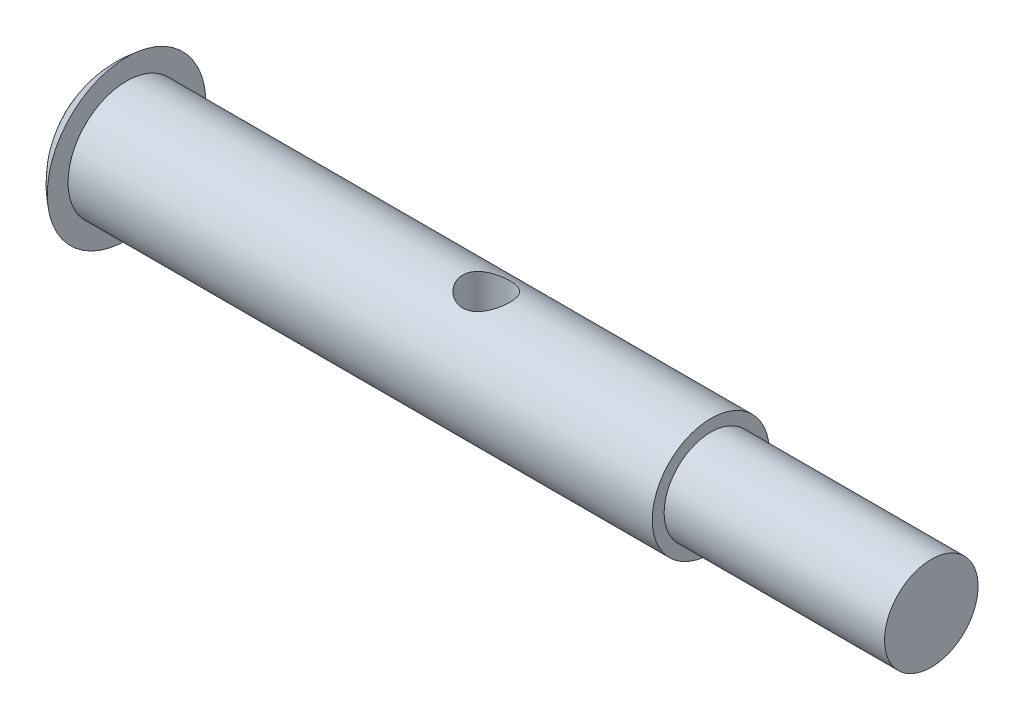
ISO-10303-21;
HEADER;
FILE_DESCRIPTION(('STEP AP214'),'2;1');
FILE_NAME('part.step','',(''),(''),'','','');
FILE_SCHEMA(('AUTOMOTIVE_DESIGN { 1 0 10303 214 1 1 1 1 }'));
ENDSEC;
DATA;
#1=APPLICATION_CONTEXT('core data for automotive mechanical design processes');
#2=APPLICATION_PROTOCOL_DEFINITION('international standard','automotive_design',2000,#1);
#3=PRODUCT_CONTEXT('',#1,'mechanical');
#4=PRODUCT('Part','Part','',(#3));
#5=PRODUCT_RELATED_PRODUCT_CATEGORY('part','',(#4));
#6=PRODUCT_DEFINITION_FORMATION('','',#4);
#7=PRODUCT_DEFINITION_CONTEXT('part definition',#1,'design');
#8=PRODUCT_DEFINITION('design','',#6,#7);
#9=PRODUCT_DEFINITION_SHAPE('','',#8);
#10=(LENGTH_UNIT() NAMED_UNIT(*) SI_UNIT(.MILLI.,.METRE.));
#11=(NAMED_UNIT(*) PLANE_ANGLE_UNIT() SI_UNIT($,.RADIAN.));
#12=(NAMED_UNIT(*) SI_UNIT($,.STERADIAN.) SOLID_ANGLE_UNIT());
#13=UNCERTAINTY_MEASURE_WITH_UNIT(LENGTH_MEASURE(1.E-05),#10,'distance_accuracy_value','');
#14=(GEOMETRIC_REPRESENTATION_CONTEXT(3) GLOBAL_UNCERTAINTY_ASSIGNED_CONTEXT((#13)) GLOBAL_UNIT_ASSIGNED_CONTEXT((#10,
#11,#12)) REPRESENTATION_CONTEXT('',''));
#15=CARTESIAN_POINT('',(0.,0.,0.));
#16=DIRECTION('',(0.,0.,1.));
#17=DIRECTION('',(1.,0.,0.));
#18=AXIS2_PLACEMENT_3D('',#15,#16,#17);
#19=CARTESIAN_POINT('',(2.52749538461538,0.,0.));
#20=DIRECTION('',(-1.,0.,0.));
#21=DIRECTION('',(0.,1.,0.));
#22=AXIS2_PLACEMENT_3D('',#19,#20,#21);
#23=SPHERICAL_SURFACE('',#22,4.17849538461538);
#24=CARTESIAN_POINT('',(0.,0.,0.));
#25=DIRECTION('',(-1.,0.,0.));
#26=DIRECTION('',(0.,0.,1.));
#27=AXIS2_PLACEMENT_3D('',#24,#25,#26);
#28=CIRCLE('',#27,3.3274);
#29=CARTESIAN_POINT('',(0.,0.,3.3274));
#30=VERTEX_POINT('',#29);
#31=EDGE_CURVE('E82',#30,#30,#28,.T.);
#32=ORIENTED_EDGE('',*,*,#31,.T.);
#33=EDGE_LOOP('',(#32));
#34=FACE_BOUND('',#33,.T.);
#35=ADVANCED_FACE('F31',(#34),#23,.T.);
#36=CARTESIAN_POINT('',(33.7566,1.96215,0.));
#37=DIRECTION('',(-1.,0.,0.));
#38=DIRECTION('',(0.,0.,1.));
#39=AXIS2_PLACEMENT_3D('',#36,#37,#38);
#40=PLANE('',#39);
#41=CARTESIAN_POINT('',(33.7566,0.,0.));
#42=DIRECTION('',(-1.,0.,0.));
#43=DIRECTION('',(0.,0.,1.));
#44=AXIS2_PLACEMENT_3D('',#41,#42,#43);
#45=CIRCLE('',#44,1.96215);
#46=CARTESIAN_POINT('',(33.7566,0.,1.96215));
#47=VERTEX_POINT('',#46);
#48=EDGE_CURVE('E10',#47,#47,#45,.T.);
#49=ORIENTED_EDGE('',*,*,#48,.F.);
#50=EDGE_LOOP('',(#49));
#51=FACE_BOUND('',#50,.T.);
#52=ADVANCED_FACE('F74',(#51),#40,.F.);
#53=CARTESIAN_POINT('',(0.,0.,0.));
#54=DIRECTION('',(-1.,0.,0.));
#55=DIRECTION('',(0.,0.,1.));
#56=AXIS2_PLACEMENT_3D('',#53,#54,#55);
#57=CYLINDRICAL_SURFACE('',#56,1.96215);
#58=CARTESIAN_POINT('',(24.511,0.,0.));
#59=DIRECTION('',(-1.,0.,0.));
#60=DIRECTION('',(0.,0.,1.));
#61=AXIS2_PLACEMENT_3D('',#58,#59,#60);
#62=CIRCLE('',#61,1.96215);
#63=CARTESIAN_POINT('',(24.511,0.,1.96215));
#64=VERTEX_POINT('',#63);
#65=EDGE_CURVE('E42',#64,#64,#62,.T.);
#66=ORIENTED_EDGE('',*,*,#65,.F.);
#67=EDGE_LOOP('',(#66));
#68=FACE_BOUND('',#67,.T.);
#69=ORIENTED_EDGE('',*,*,#48,.T.);
#70=EDGE_LOOP('',(#69));
#71=FACE_BOUND('',#70,.T.);
#72=ADVANCED_FACE('F79',(#68,#71),#57,.T.);
#73=CARTESIAN_POINT('',(24.511,2.45745,0.));
#74=DIRECTION('',(-1.,0.,0.));
#75=DIRECTION('',(0.,0.,1.));
#76=AXIS2_PLACEMENT_3D('',#73,#74,#75);
#77=PLANE('',#76);
#78=CARTESIAN_POINT('',(24.511,0.,0.));
#79=DIRECTION('',(-1.,0.,0.));
#80=DIRECTION('',(0.,0.,1.));
#81=AXIS2_PLACEMENT_3D('',#78,#79,#80);
#82=CIRCLE('',#81,2.45745);
#83=CARTESIAN_POINT('',(24.511,0.,2.45745));
#84=VERTEX_POINT('',#83);
#85=EDGE_CURVE('E47',#84,#84,#82,.T.);
#86=ORIENTED_EDGE('',*,*,#85,.F.);
#87=EDGE_LOOP('',(#86));
#88=FACE_BOUND('',#87,.T.);
#89=ORIENTED_EDGE('',*,*,#65,.T.);
#90=EDGE_LOOP('',(#89));
#91=FACE_BOUND('',#90,.T.);
#92=ADVANCED_FACE('F69',(#88,#91),#77,.F.);
#93=CARTESIAN_POINT('',(0.,0.,0.));
#94=DIRECTION('',(-1.,0.,0.));
#95=DIRECTION('',(0.,0.,1.));
#96=AXIS2_PLACEMENT_3D('',#93,#94,#95);
#97=CYLINDRICAL_SURFACE('',#96,2.45745);
#98=CARTESIAN_POINT('',(15.0876,-2.24894911958897,0.990600000000001));
#99=CARTESIAN_POINT('',(15.1406092142013,-2.2489539403931,0.990594883395186));
#100=CARTESIAN_POINT('',(15.1937117818322,-2.25085041266254,0.986318184521201));
#101=CARTESIAN_POINT('',(15.29839478457,-2.25819807241842,0.969371908157784));
#102=CARTESIAN_POINT('',(15.3499705460349,-2.26365918917481,0.956678885541777));
#103=CARTESIAN_POINT('',(15.4499012637466,-2.27740934288236,0.923464359557311));
#104=CARTESIAN_POINT('',(15.4982679250268,-2.28568734080513,0.902973378929544));
#105=CARTESIAN_POINT('',(15.5908617820206,-2.30412268632457,0.854833757596454));
#106=CARTESIAN_POINT('',(15.6350901374237,-2.31427950502426,0.827187130367488));
#107=CARTESIAN_POINT('',(15.7207528721112,-2.33598949570862,0.763800911639134));
#108=CARTESIAN_POINT('',(15.7619170370233,-2.34758805305742,0.727711508573723));
#109=CARTESIAN_POINT('',(15.8378070309952,-2.3705002662306,0.649199752360465));
#110=CARTESIAN_POINT('',(15.872530468698,-2.38181381489308,0.606775057513118));
#111=CARTESIAN_POINT('',(15.9358998686949,-2.40342686867888,0.51470467128262));
#112=CARTESIAN_POINT('',(15.9642459376805,-2.41366744227196,0.464837486163864));
#113=CARTESIAN_POINT('',(16.0120313416552,-2.43142986724061,0.360555800006824));
#114=CARTESIAN_POINT('',(16.0314743909268,-2.43895285209967,0.306143206507078));
#115=CARTESIAN_POINT('',(16.0599352358124,-2.45011121795251,0.19714810345064));
#116=CARTESIAN_POINT('',(16.0694178720317,-2.45391928248367,0.142705007849733));
#117=CARTESIAN_POINT('',(16.0791864790995,-2.45784346670032,0.032876053131032));
#118=CARTESIAN_POINT('',(16.0794759296195,-2.45796098327838,-0.0225094413412587));
#119=CARTESIAN_POINT('',(16.0711027206045,-2.45459528368632,-0.129287199751809));
#120=CARTESIAN_POINT('',(16.0629496483228,-2.4513170310017,-0.180727063337104));
#121=CARTESIAN_POINT('',(16.0387908439381,-2.44180537076067,-0.281436513553462));
#122=CARTESIAN_POINT('',(16.022784535351,-2.43557174625977,-0.330705940569415));
#123=CARTESIAN_POINT('',(15.9831779784075,-2.42063870123337,-0.42656725860649));
#124=CARTESIAN_POINT('',(15.959466596276,-2.41190343171928,-0.473107417596286));
#125=CARTESIAN_POINT('',(15.905227937674,-2.3928317692047,-0.561668723052615));
#126=CARTESIAN_POINT('',(15.8746983102562,-2.38249482432002,-0.603688303390175));
#127=CARTESIAN_POINT('',(15.8053227212193,-2.36045473895841,-0.684985005876058));
#128=CARTESIAN_POINT('',(15.7660585169967,-2.34870645949337,-0.723893510328676));
#129=CARTESIAN_POINT('',(15.6815201438698,-2.32569575134905,-0.794726252527889));
#130=CARTESIAN_POINT('',(15.636243953463,-2.31443348778553,-0.82664813145077));
#131=CARTESIAN_POINT('',(15.5392935246042,-2.29336013633767,-0.883463224418093));
#132=CARTESIAN_POINT('',(15.4874715577675,-2.28360075060554,-0.908125142778779));
#133=CARTESIAN_POINT('',(15.3799119729093,-2.26724605051114,-0.948224879823791));
#134=CARTESIAN_POINT('',(15.3241769724546,-2.26064864367914,-0.963668800271402));
#135=CARTESIAN_POINT('',(15.2140539367204,-2.25187478107706,-0.983989977951191));
#136=CARTESIAN_POINT('',(15.1597955768932,-2.24945027342209,-0.989461353029105));
#137=CARTESIAN_POINT('',(15.051093648822,-2.24858955395276,-0.991417169373309));
#138=CARTESIAN_POINT('',(14.9966501433784,-2.25015210287508,-0.987904403104038));
#139=CARTESIAN_POINT('',(14.8924574407903,-2.25683454392309,-0.972532834316518));
#140=CARTESIAN_POINT('',(14.8426194875695,-2.26174201623547,-0.961171879736541));
#141=CARTESIAN_POINT('',(14.7455916868893,-2.27429639330394,-0.931074816470888));
#142=CARTESIAN_POINT('',(14.6984024351546,-2.28194391149626,-0.91233705618723));
#143=CARTESIAN_POINT('',(14.6058581602916,-2.29949913968596,-0.867163524567918));
#144=CARTESIAN_POINT('',(14.5606571225867,-2.30948650638215,-0.840444220255149));
#145=CARTESIAN_POINT('',(14.4751724206465,-2.33047616641533,-0.780354472980375));
#146=CARTESIAN_POINT('',(14.4348907935572,-2.34147887692108,-0.746981289581171));
#147=CARTESIAN_POINT('',(14.3572375525648,-2.36425892821556,-0.671567777120808));
#148=CARTESIAN_POINT('',(14.3203128717473,-2.37603227040539,-0.629064281035669));
#149=CARTESIAN_POINT('',(14.2540487145552,-2.39825010462983,-0.538184541280385));
#150=CARTESIAN_POINT('',(14.2247095917759,-2.40869453470666,-0.489808023998034));
#151=CARTESIAN_POINT('',(14.1745448270921,-2.42711680118995,-0.388355247919027));
#152=CARTESIAN_POINT('',(14.1537212272328,-2.43509404584713,-0.335277865550409));
#153=CARTESIAN_POINT('',(14.1214387845874,-2.44765523407475,-0.225972068079359));
#154=CARTESIAN_POINT('',(14.1099747647901,-2.45224105339253,-0.169745413333621));
#155=CARTESIAN_POINT('',(14.0973581118665,-2.45729958214545,-0.0597465002267287));
#156=CARTESIAN_POINT('',(14.0955738979861,-2.45802416634502,-0.00605772146768201));
#157=CARTESIAN_POINT('',(14.1006941195384,-2.45596203239521,0.100829284162529));
#158=CARTESIAN_POINT('',(14.1075971984091,-2.45317586246672,0.154027586317364));
#159=CARTESIAN_POINT('',(14.1294441074949,-2.4445325270318,0.256699834667083));
#160=CARTESIAN_POINT('',(14.1441271748982,-2.43877510361329,0.306238339460207));
#161=CARTESIAN_POINT('',(14.1808415573706,-2.42480838128585,0.402138464582342));
#162=CARTESIAN_POINT('',(14.2028743118945,-2.41659860210981,0.448499460442389));
#163=CARTESIAN_POINT('',(14.2547642910696,-2.39807736618839,0.538993056991721));
#164=CARTESIAN_POINT('',(14.2849257021562,-2.38768872922797,0.582935090732998));
#165=CARTESIAN_POINT('',(14.3517616136099,-2.36605819825332,0.665316551286097));
#166=CARTESIAN_POINT('',(14.38843832932,-2.35481601476186,0.703754098400168));
#167=CARTESIAN_POINT('',(14.4699911431742,-2.33186380210035,0.776543117622088));
#168=CARTESIAN_POINT('',(14.5152378400618,-2.32016881507587,0.81048558621844));
#169=CARTESIAN_POINT('',(14.6111672281868,-2.29838717053167,0.870342373324756));
#170=CARTESIAN_POINT('',(14.6618528434755,-2.28830138546427,0.896252344028879));
#171=CARTESIAN_POINT('',(14.7668807220301,-2.27111748811246,0.938942885633635));
#172=CARTESIAN_POINT('',(14.8211865940028,-2.263993687779,0.955802336868846));
#173=CARTESIAN_POINT('',(14.9321339816757,-2.25364625462214,0.979958833150334));
#174=CARTESIAN_POINT('',(14.9887669950462,-2.25040953851769,0.987287962614266));
#175=CARTESIAN_POINT('',(15.0595499687453,-2.24907904719398,0.990303553852822));
#176=CARTESIAN_POINT('',(15.0735717154346,-2.24894784381808,0.990601354051168));
#177=CARTESIAN_POINT('',(15.0876,-2.24894911958897,0.990600000000001));
#178=B_SPLINE_CURVE_WITH_KNOTS('',3,(#98,#99,#100,#101,#102,#103,#104,#105,#106,#107,#108,#109,
#110,#111,#112,#113,#114,#115,#116,#117,#118,#119,#120,#121,#122,#123,#124,#125,#126,#127,#128,
#129,#130,#131,#132,#133,#134,#135,#136,#137,#138,#139,#140,#141,#142,#143,#144,#145,#146,#147,
#148,#149,#150,#151,#152,#153,#154,#155,#156,#157,#158,#159,#160,#161,#162,#163,#164,#165,#166,
#167,#168,#169,#170,#171,#172,#173,#174,#175,#176,#177),.UNSPECIFIED.,.T.,.F.,(4,2,2,2,2,2,2,2,
2,2,2,2,2,2,2,2,2,2,2,2,2,2,2,2,2,2,2,2,2,2,2,2,2,2,2,2,2,2,2,4),(0.,0.158989595529892,
0.318423955298766,0.477240571605475,0.636012548128621,0.803154722040391,0.970358829959495,
1.1442744421613,1.31811743163447,1.48342811584032,1.64867622829381,1.80450042928587,
1.96033607061104,2.11852734800709,2.27677325458184,2.44555054923949,2.61438473886722,
2.78812686876637,2.96175386385342,3.12464906419392,3.28749363935484,3.44085675334786,
3.59425422345659,3.75392637259233,3.91366441994493,4.08542021576384,4.25718401641151,
4.42898898235759,4.60069885429948,4.76105700910075,4.92139012631893,5.07666084164426,
5.23196198500372,5.39416417559913,5.55642162434512,5.72888351514553,5.90143859325839,
6.07246428060505,6.24291269586496,6.28498748083635),.UNSPECIFIED.);
#179=CARTESIAN_POINT('',(15.0876,-2.24894911958897,0.990600000000001));
#180=VERTEX_POINT('',#179);
#181=EDGE_CURVE('E34',#180,#180,#178,.T.);
#182=ORIENTED_EDGE('',*,*,#181,.T.);
#183=EDGE_LOOP('',(#182));
#184=FACE_BOUND('',#183,.T.);
#185=CARTESIAN_POINT('',(15.0876,2.24894911958897,0.990600000000001));
#186=CARTESIAN_POINT('',(15.0345907857987,2.2489539403931,0.990594883395186));
#187=CARTESIAN_POINT('',(14.9814882181678,2.25085041266254,0.986318184521201));
#188=CARTESIAN_POINT('',(14.87680521543,2.25819807241842,0.969371908157785));
#189=CARTESIAN_POINT('',(14.8252294539651,2.26365918917481,0.956678885541777));
#190=CARTESIAN_POINT('',(14.7252987362534,2.27740934288236,0.923464359557311));
#191=CARTESIAN_POINT('',(14.6769320749732,2.28568734080513,0.902973378929544));
#192=CARTESIAN_POINT('',(14.5843382179794,2.30412268632457,0.854833757596454));
#193=CARTESIAN_POINT('',(14.5401098625763,2.31427950502426,0.827187130367488));
#194=CARTESIAN_POINT('',(14.4544471278888,2.33598949570862,0.763800911639134));
#195=CARTESIAN_POINT('',(14.4132829629767,2.34758805305742,0.727711508573725));
#196=CARTESIAN_POINT('',(14.3373929690048,2.3705002662306,0.649199752360467));
#197=CARTESIAN_POINT('',(14.302669531302,2.38181381489308,0.60677505751312));
#198=CARTESIAN_POINT('',(14.2393001313051,2.40342686867888,0.514704671282621));
#199=CARTESIAN_POINT('',(14.2109540623195,2.41366744227196,0.464837486163865));
#200=CARTESIAN_POINT('',(14.1631686583448,2.43142986724061,0.360555800006826));
#201=CARTESIAN_POINT('',(14.1437256090732,2.43895285209967,0.306143206507079));
#202=CARTESIAN_POINT('',(14.1152647641876,2.45011121795251,0.19714810345064));
#203=CARTESIAN_POINT('',(14.1057821279683,2.45391928248367,0.142705007849733));
#204=CARTESIAN_POINT('',(14.0960135209005,2.45784346670032,0.0328760531310321));
#205=CARTESIAN_POINT('',(14.0957240703805,2.45796098327838,-0.0225094413412586));
#206=CARTESIAN_POINT('',(14.1040972793955,2.45459528368632,-0.129287199751809));
#207=CARTESIAN_POINT('',(14.1122503516772,2.4513170310017,-0.180727063337105));
#208=CARTESIAN_POINT('',(14.1364091560619,2.44180537076067,-0.281436513553463));
#209=CARTESIAN_POINT('',(14.1524154646491,2.43557174625977,-0.330705940569415));
#210=CARTESIAN_POINT('',(14.1920220215925,2.42063870123337,-0.426567258606491));
#211=CARTESIAN_POINT('',(14.215733403724,2.41190343171928,-0.473107417596286));
#212=CARTESIAN_POINT('',(14.269972062326,2.3928317692047,-0.561668723052615));
#213=CARTESIAN_POINT('',(14.3005016897438,2.38249482432002,-0.603688303390175));
#214=CARTESIAN_POINT('',(14.3698772787807,2.36045473895841,-0.684985005876058));
#215=CARTESIAN_POINT('',(14.4091414830033,2.34870645949337,-0.723893510328676));
#216=CARTESIAN_POINT('',(14.4936798561302,2.32569575134905,-0.79472625252789));
#217=CARTESIAN_POINT('',(14.538956046537,2.31443348778553,-0.826648131450771));
#218=CARTESIAN_POINT('',(14.6359064753958,2.29336013633767,-0.883463224418094));
#219=CARTESIAN_POINT('',(14.6877284422325,2.28360075060554,-0.90812514277878));
#220=CARTESIAN_POINT('',(14.7952880270907,2.26724605051114,-0.948224879823791));
#221=CARTESIAN_POINT('',(14.8510230275454,2.26064864367914,-0.963668800271402));
#222=CARTESIAN_POINT('',(14.9611460632796,2.25187478107706,-0.983989977951191));
#223=CARTESIAN_POINT('',(15.0154044231068,2.24945027342209,-0.989461353029105));
#224=CARTESIAN_POINT('',(15.124106351178,2.24858955395276,-0.991417169373309));
#225=CARTESIAN_POINT('',(15.1785498566216,2.25015210287508,-0.987904403104038));
#226=CARTESIAN_POINT('',(15.2827425592097,2.25683454392309,-0.972532834316518));
#227=CARTESIAN_POINT('',(15.3325805124305,2.26174201623547,-0.961171879736541));
#228=CARTESIAN_POINT('',(15.4296083131107,2.27429639330394,-0.931074816470888));
#229=CARTESIAN_POINT('',(15.4767975648454,2.28194391149626,-0.91233705618723));
#230=CARTESIAN_POINT('',(15.5693418397084,2.29949913968596,-0.867163524567918));
#231=CARTESIAN_POINT('',(15.6145428774133,2.30948650638215,-0.840444220255149));
#232=CARTESIAN_POINT('',(15.7000275793535,2.33047616641533,-0.780354472980375));
#233=CARTESIAN_POINT('',(15.7403092064428,2.34147887692108,-0.746981289581172));
#234=CARTESIAN_POINT('',(15.8179624474352,2.36425892821556,-0.671567777120809));
#235=CARTESIAN_POINT('',(15.8548871282527,2.37603227040539,-0.629064281035669));
#236=CARTESIAN_POINT('',(15.9211512854448,2.39825010462983,-0.538184541280383));
#237=CARTESIAN_POINT('',(15.9504904082241,2.40869453470666,-0.489808023998032));
#238=CARTESIAN_POINT('',(16.0006551729079,2.42711680118995,-0.388355247919024));
#239=CARTESIAN_POINT('',(16.0214787727672,2.43509404584713,-0.335277865550406));
#240=CARTESIAN_POINT('',(16.0537612154126,2.44765523407475,-0.225972068079357));
#241=CARTESIAN_POINT('',(16.0652252352099,2.45224105339253,-0.16974541333362));
#242=CARTESIAN_POINT('',(16.0778418881335,2.45729958214545,-0.0597465002267291));
#243=CARTESIAN_POINT('',(16.0796261020139,2.45802416634502,-0.00605772146768248));
#244=CARTESIAN_POINT('',(16.0745058804616,2.45596203239521,0.100829284162528));
#245=CARTESIAN_POINT('',(16.0676028015908,2.45317586246672,0.154027586317364));
#246=CARTESIAN_POINT('',(16.0457558925051,2.4445325270318,0.256699834667083));
#247=CARTESIAN_POINT('',(16.0310728251018,2.43877510361329,0.306238339460208));
#248=CARTESIAN_POINT('',(15.9943584426294,2.42480838128585,0.402138464582342));
#249=CARTESIAN_POINT('',(15.9723256881055,2.41659860210981,0.44849946044239));
#250=CARTESIAN_POINT('',(15.9204357089304,2.39807736618839,0.538993056991722));
#251=CARTESIAN_POINT('',(15.8902742978438,2.38768872922797,0.582935090732997));
#252=CARTESIAN_POINT('',(15.8234383863901,2.36605819825332,0.665316551286096));
#253=CARTESIAN_POINT('',(15.78676167068,2.35481601476185,0.703754098400169));
#254=CARTESIAN_POINT('',(15.7052088568258,2.33186380210035,0.776543117622089));
#255=CARTESIAN_POINT('',(15.6599621599382,2.32016881507587,0.810485586218441));
#256=CARTESIAN_POINT('',(15.5640327718132,2.29838717053167,0.870342373324757));
#257=CARTESIAN_POINT('',(15.5133471565245,2.28830138546427,0.896252344028879));
#258=CARTESIAN_POINT('',(15.4083192779699,2.27111748811246,0.938942885633635));
#259=CARTESIAN_POINT('',(15.3540134059972,2.263993687779,0.955802336868846));
#260=CARTESIAN_POINT('',(15.2430660183243,2.25364625462214,0.979958833150334));
#261=CARTESIAN_POINT('',(15.1864330049538,2.25040953851769,0.987287962614266));
#262=CARTESIAN_POINT('',(15.1156500312547,2.24907904719398,0.990303553852822));
#263=CARTESIAN_POINT('',(15.1016282845654,2.24894784381808,0.990601354051168));
#264=CARTESIAN_POINT('',(15.0876,2.24894911958897,0.990600000000001));
#265=B_SPLINE_CURVE_WITH_KNOTS('',3,(#185,#186,#187,#188,#189,#190,#191,#192,#193,#194,#195,
#196,#197,#198,#199,#200,#201,#202,#203,#204,#205,#206,#207,#208,#209,#210,#211,#212,#213,#214,
#215,#216,#217,#218,#219,#220,#221,#222,#223,#224,#225,#226,#227,#228,#229,#230,#231,#232,#233,
#234,#235,#236,#237,#238,#239,#240,#241,#242,#243,#244,#245,#246,#247,#248,#249,#250,#251,#252,
#253,#254,#255,#256,#257,#258,#259,#260,#261,#262,#263,#264),.UNSPECIFIED.,.T.,.F.,(4,2,2,2,2,2,
2,2,2,2,2,2,2,2,2,2,2,2,2,2,2,2,2,2,2,2,2,2,2,2,2,2,2,2,2,2,2,2,2,4),(0.,0.15898959552989,
0.318423955298766,0.477240571605475,0.636012548128621,0.803154722040386,0.970358829959493,
1.1442744421613,1.31811743163447,1.48342811584032,1.64867622829381,1.80450042928587,
1.96033607061104,2.11852734800709,2.27677325458184,2.44555054923949,2.61438473886722,
2.78812686876637,2.96175386385342,3.12464906419392,3.28749363935484,3.44085675334786,
3.59425422345659,3.75392637259233,3.91366441994493,4.08542021576385,4.25718401641152,
4.42898898235759,4.60069885429948,4.76105700910075,4.92139012631893,5.07666084164426,
5.23196198500372,5.39416417559914,5.55642162434512,5.72888351514553,5.90143859325839,
6.07246428060505,6.24291269586496,6.28498748083636),.UNSPECIFIED.);
#266=CARTESIAN_POINT('',(15.0876,2.24894911958897,0.990600000000001));
#267=VERTEX_POINT('',#266);
#268=EDGE_CURVE('E50',#267,#267,#265,.T.);
#269=ORIENTED_EDGE('',*,*,#268,.T.);
#270=EDGE_LOOP('',(#269));
#271=FACE_BOUND('',#270,.T.);
#272=CARTESIAN_POINT('',(0.,0.,0.));
#273=DIRECTION('',(-1.,0.,0.));
#274=DIRECTION('',(0.,0.,1.));
#275=AXIS2_PLACEMENT_3D('',#272,#273,#274);
#276=CIRCLE('',#275,2.45745);
#277=CARTESIAN_POINT('',(0.,0.,2.45745));
#278=VERTEX_POINT('',#277);
#279=EDGE_CURVE('E83',#278,#278,#276,.T.);
#280=ORIENTED_EDGE('',*,*,#279,.F.);
#281=EDGE_LOOP('',(#280));
#282=FACE_BOUND('',#281,.T.);
#283=ORIENTED_EDGE('',*,*,#85,.T.);
#284=EDGE_LOOP('',(#283));
#285=FACE_BOUND('',#284,.T.);
#286=ADVANCED_FACE('F54',(#184,#271,#282,#285),#97,.T.);
#287=CARTESIAN_POINT('',(0.,3.3274,0.));
#288=DIRECTION('',(-1.,0.,0.));
#289=DIRECTION('',(0.,0.,1.));
#290=AXIS2_PLACEMENT_3D('',#287,#288,#289);
#291=PLANE('',#290);
#292=ORIENTED_EDGE('',*,*,#31,.F.);
#293=EDGE_LOOP('',(#292));
#294=FACE_BOUND('',#293,.T.);
#295=ORIENTED_EDGE('',*,*,#279,.T.);
#296=EDGE_LOOP('',(#295));
#297=FACE_BOUND('',#296,.T.);
#298=ADVANCED_FACE('F61',(#294,#297),#291,.F.);
#299=CARTESIAN_POINT('',(15.0876,-3.3274,0.));
#300=DIRECTION('',(0.,1.,0.));
#301=DIRECTION('',(0.,0.,1.));
#302=AXIS2_PLACEMENT_3D('',#299,#300,#301);
#303=CYLINDRICAL_SURFACE('',#302,0.990600000000001);
#304=ORIENTED_EDGE('',*,*,#268,.F.);
#305=EDGE_LOOP('',(#304));
#306=FACE_BOUND('',#305,.T.);
#307=ORIENTED_EDGE('',*,*,#181,.F.);
#308=EDGE_LOOP('',(#307));
#309=FACE_BOUND('',#308,.T.);
#310=ADVANCED_FACE('F58',(#306,#309),#303,.F.);
#311=CLOSED_SHELL('',(#35,#52,#72,#92,#286,#298,#310));
#312=MANIFOLD_SOLID_BREP('B2',#311);
#313=ADVANCED_BREP_SHAPE_REPRESENTATION('',(#18,#312),#14);
#314=SHAPE_DEFINITION_REPRESENTATION(#9,#313);
ENDSEC;
END-ISO-10303-21;
